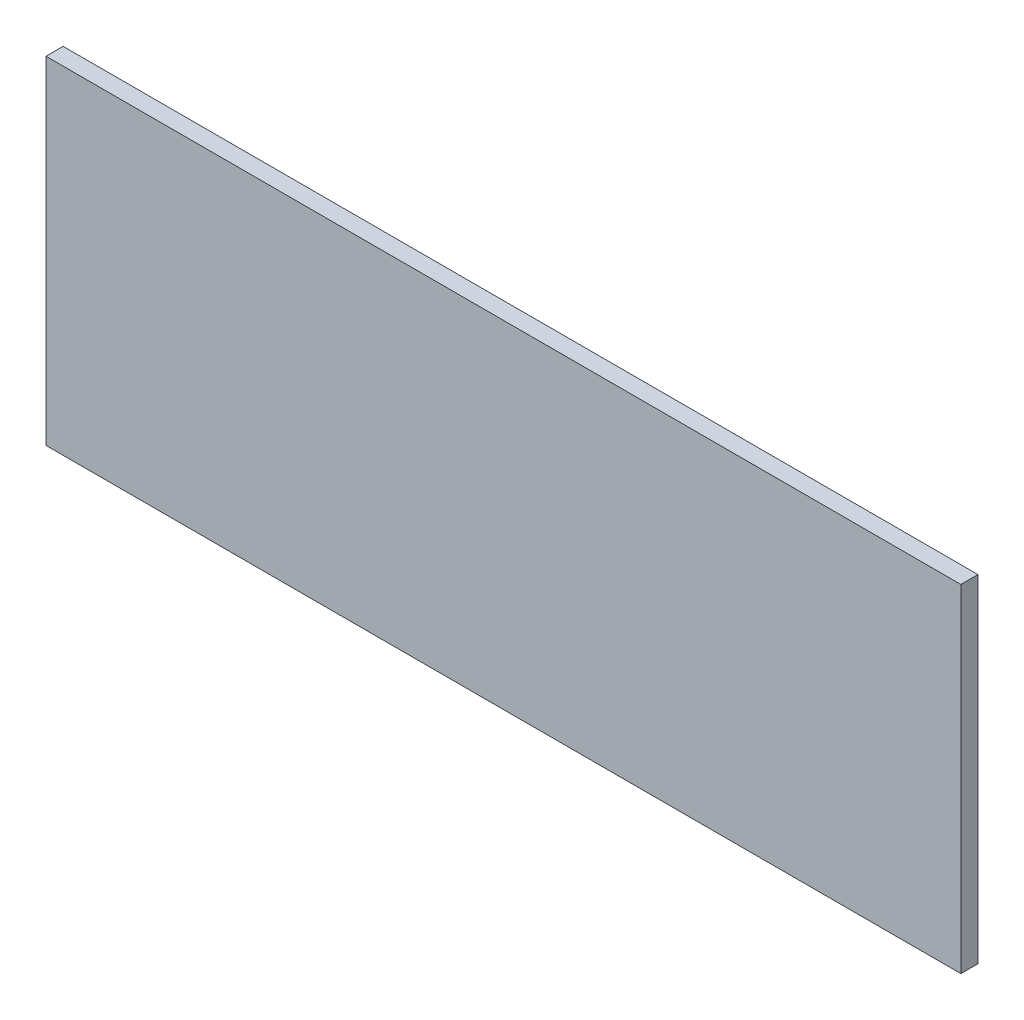
ISO-10303-21;
HEADER;
FILE_DESCRIPTION(('STEP AP214'),'2;1');
FILE_NAME('part.step','',(''),(''),'','','');
FILE_SCHEMA(('AUTOMOTIVE_DESIGN { 1 0 10303 214 1 1 1 1 }'));
ENDSEC;
DATA;
#1=APPLICATION_CONTEXT('core data for automotive mechanical design processes');
#2=APPLICATION_PROTOCOL_DEFINITION('international standard','automotive_design',2000,#1);
#3=PRODUCT_CONTEXT('',#1,'mechanical');
#4=PRODUCT('Part','Part','',(#3));
#5=PRODUCT_RELATED_PRODUCT_CATEGORY('part','',(#4));
#6=PRODUCT_DEFINITION_FORMATION('','',#4);
#7=PRODUCT_DEFINITION_CONTEXT('part definition',#1,'design');
#8=PRODUCT_DEFINITION('design','',#6,#7);
#9=PRODUCT_DEFINITION_SHAPE('','',#8);
#10=(LENGTH_UNIT() NAMED_UNIT(*) SI_UNIT(.MILLI.,.METRE.));
#11=(NAMED_UNIT(*) PLANE_ANGLE_UNIT() SI_UNIT($,.RADIAN.));
#12=(NAMED_UNIT(*) SI_UNIT($,.STERADIAN.) SOLID_ANGLE_UNIT());
#13=UNCERTAINTY_MEASURE_WITH_UNIT(LENGTH_MEASURE(1.E-05),#10,'distance_accuracy_value','');
#14=(GEOMETRIC_REPRESENTATION_CONTEXT(3) GLOBAL_UNCERTAINTY_ASSIGNED_CONTEXT((#13)) GLOBAL_UNIT_ASSIGNED_CONTEXT((#10,
#11,#12)) REPRESENTATION_CONTEXT('',''));
#15=CARTESIAN_POINT('',(0.,0.,0.));
#16=DIRECTION('',(0.,0.,1.));
#17=DIRECTION('',(1.,0.,0.));
#18=AXIS2_PLACEMENT_3D('',#15,#16,#17);
#19=CARTESIAN_POINT('',(96.5670013427734,68.8369979858399,0.));
#20=DIRECTION('',(0.,1.,0.));
#21=DIRECTION('',(1.,0.,0.));
#22=AXIS2_PLACEMENT_3D('',#19,#20,#21);
#23=PLANE('',#22);
#24=DIRECTION('',(1.,0.,0.));
#25=VECTOR('',#24,1.);
#26=CARTESIAN_POINT('',(96.5670013427734,68.8369979858398,0.03556));
#27=LINE('',#26,#25);
#28=CARTESIAN_POINT('',(96.5670013427734,68.8369979858398,0.03556));
#29=VERTEX_POINT('',#28);
#30=CARTESIAN_POINT('',(98.4670028686523,68.8369979858398,0.03556));
#31=VERTEX_POINT('',#30);
#32=EDGE_CURVE('E11',#29,#31,#27,.T.);
#33=ORIENTED_EDGE('',*,*,#32,.F.);
#34=DIRECTION('',(0.,0.,1.));
#35=VECTOR('',#34,1.);
#36=CARTESIAN_POINT('',(96.5670013427734,68.8369979858398,0.));
#37=LINE('',#36,#35);
#38=CARTESIAN_POINT('',(96.5670013427734,68.8369979858398,0.));
#39=VERTEX_POINT('',#38);
#40=EDGE_CURVE('E24',#39,#29,#37,.T.);
#41=ORIENTED_EDGE('',*,*,#40,.F.);
#42=DIRECTION('',(1.,0.,0.));
#43=VECTOR('',#42,1.);
#44=CARTESIAN_POINT('',(96.5670013427734,68.8369979858398,0.));
#45=LINE('',#44,#43);
#46=CARTESIAN_POINT('',(98.4670028686523,68.8369979858398,0.));
#47=VERTEX_POINT('',#46);
#48=EDGE_CURVE('E75',#39,#47,#45,.T.);
#49=ORIENTED_EDGE('',*,*,#48,.T.);
#50=DIRECTION('',(0.,0.,1.));
#51=VECTOR('',#50,1.);
#52=CARTESIAN_POINT('',(98.4670028686523,68.8369979858398,0.));
#53=LINE('',#52,#51);
#54=EDGE_CURVE('E37',#47,#31,#53,.T.);
#55=ORIENTED_EDGE('',*,*,#54,.T.);
#56=EDGE_LOOP('',(#33,#41,#49,#55));
#57=FACE_BOUND('',#56,.T.);
#58=ADVANCED_FACE('F17',(#57),#23,.F.);
#59=CARTESIAN_POINT('',(98.4670028686523,68.8369979858399,0.));
#60=DIRECTION('',(-1.,0.,0.));
#61=DIRECTION('',(0.,1.,0.));
#62=AXIS2_PLACEMENT_3D('',#59,#60,#61);
#63=PLANE('',#62);
#64=DIRECTION('',(0.,1.,0.));
#65=VECTOR('',#64,1.);
#66=CARTESIAN_POINT('',(98.4670028686523,68.8369979858398,0.03556));
#67=LINE('',#66,#65);
#68=CARTESIAN_POINT('',(98.4670028686523,69.5370025634766,0.03556));
#69=VERTEX_POINT('',#68);
#70=EDGE_CURVE('E83',#31,#69,#67,.T.);
#71=ORIENTED_EDGE('',*,*,#70,.F.);
#72=ORIENTED_EDGE('',*,*,#54,.F.);
#73=DIRECTION('',(0.,1.,0.));
#74=VECTOR('',#73,1.);
#75=CARTESIAN_POINT('',(98.4670028686523,68.8369979858398,0.));
#76=LINE('',#75,#74);
#77=CARTESIAN_POINT('',(98.4670028686523,69.5370025634766,0.));
#78=VERTEX_POINT('',#77);
#79=EDGE_CURVE('E81',#47,#78,#76,.T.);
#80=ORIENTED_EDGE('',*,*,#79,.T.);
#81=DIRECTION('',(0.,0.,1.));
#82=VECTOR('',#81,1.);
#83=CARTESIAN_POINT('',(98.4670028686523,69.5370025634766,0.));
#84=LINE('',#83,#82);
#85=EDGE_CURVE('E67',#78,#69,#84,.T.);
#86=ORIENTED_EDGE('',*,*,#85,.T.);
#87=EDGE_LOOP('',(#71,#72,#80,#86));
#88=FACE_BOUND('',#87,.T.);
#89=ADVANCED_FACE('F89',(#88),#63,.F.);
#90=CARTESIAN_POINT('',(98.4670028686523,69.5370025634766,0.));
#91=DIRECTION('',(0.,-1.,0.));
#92=DIRECTION('',(-1.,0.,0.));
#93=AXIS2_PLACEMENT_3D('',#90,#91,#92);
#94=PLANE('',#93);
#95=DIRECTION('',(-1.,0.,0.));
#96=VECTOR('',#95,1.);
#97=CARTESIAN_POINT('',(98.4670028686523,69.5370025634766,0.03556));
#98=LINE('',#97,#96);
#99=CARTESIAN_POINT('',(96.5670013427734,69.5370025634766,0.03556));
#100=VERTEX_POINT('',#99);
#101=EDGE_CURVE('E71',#69,#100,#98,.T.);
#102=ORIENTED_EDGE('',*,*,#101,.F.);
#103=ORIENTED_EDGE('',*,*,#85,.F.);
#104=DIRECTION('',(-1.,0.,0.));
#105=VECTOR('',#104,1.);
#106=CARTESIAN_POINT('',(98.4670028686523,69.5370025634766,0.));
#107=LINE('',#106,#105);
#108=CARTESIAN_POINT('',(96.5670013427734,69.5370025634766,0.));
#109=VERTEX_POINT('',#108);
#110=EDGE_CURVE('E63',#78,#109,#107,.T.);
#111=ORIENTED_EDGE('',*,*,#110,.T.);
#112=DIRECTION('',(0.,0.,1.));
#113=VECTOR('',#112,1.);
#114=CARTESIAN_POINT('',(96.5670013427734,69.5370025634766,0.));
#115=LINE('',#114,#113);
#116=EDGE_CURVE('E53',#109,#100,#115,.T.);
#117=ORIENTED_EDGE('',*,*,#116,.T.);
#118=EDGE_LOOP('',(#102,#103,#111,#117));
#119=FACE_BOUND('',#118,.T.);
#120=ADVANCED_FACE('F66',(#119),#94,.F.);
#121=CARTESIAN_POINT('',(96.5670013427734,69.5370025634766,0.));
#122=DIRECTION('',(1.,0.,0.));
#123=DIRECTION('',(0.,-1.,0.));
#124=AXIS2_PLACEMENT_3D('',#121,#122,#123);
#125=PLANE('',#124);
#126=DIRECTION('',(0.,-1.,0.));
#127=VECTOR('',#126,1.);
#128=CARTESIAN_POINT('',(96.5670013427734,69.5370025634766,0.03556));
#129=LINE('',#128,#127);
#130=EDGE_CURVE('E59',#100,#29,#129,.T.);
#131=ORIENTED_EDGE('',*,*,#130,.F.);
#132=ORIENTED_EDGE('',*,*,#116,.F.);
#133=DIRECTION('',(0.,-1.,0.));
#134=VECTOR('',#133,1.);
#135=CARTESIAN_POINT('',(96.5670013427734,69.5370025634766,0.));
#136=LINE('',#135,#134);
#137=EDGE_CURVE('E57',#109,#39,#136,.T.);
#138=ORIENTED_EDGE('',*,*,#137,.T.);
#139=ORIENTED_EDGE('',*,*,#40,.T.);
#140=EDGE_LOOP('',(#131,#132,#138,#139));
#141=FACE_BOUND('',#140,.T.);
#142=ADVANCED_FACE('F55',(#141),#125,.F.);
#143=CARTESIAN_POINT('',(96.5670013427734,68.8369979858399,0.));
#144=DIRECTION('',(0.,0.,-1.));
#145=DIRECTION('',(-1.,0.,0.));
#146=AXIS2_PLACEMENT_3D('',#143,#144,#145);
#147=PLANE('',#146);
#148=ORIENTED_EDGE('',*,*,#137,.F.);
#149=ORIENTED_EDGE('',*,*,#110,.F.);
#150=ORIENTED_EDGE('',*,*,#79,.F.);
#151=ORIENTED_EDGE('',*,*,#48,.F.);
#152=EDGE_LOOP('',(#148,#149,#150,#151));
#153=FACE_BOUND('',#152,.T.);
#154=ADVANCED_FACE('F74',(#153),#147,.T.);
#155=CARTESIAN_POINT('',(96.5670013427734,68.8369979858399,0.03556));
#156=DIRECTION('',(0.,0.,-1.));
#157=DIRECTION('',(-1.,0.,0.));
#158=AXIS2_PLACEMENT_3D('',#155,#156,#157);
#159=PLANE('',#158);
#160=ORIENTED_EDGE('',*,*,#32,.T.);
#161=ORIENTED_EDGE('',*,*,#70,.T.);
#162=ORIENTED_EDGE('',*,*,#101,.T.);
#163=ORIENTED_EDGE('',*,*,#130,.T.);
#164=EDGE_LOOP('',(#160,#161,#162,#163));
#165=FACE_BOUND('',#164,.T.);
#166=ADVANCED_FACE('F91',(#165),#159,.F.);
#167=CLOSED_SHELL('',(#58,#89,#120,#142,#154,#166));
#168=MANIFOLD_SOLID_BREP('B1',#167);
#169=ADVANCED_BREP_SHAPE_REPRESENTATION('',(#18,#168),#14);
#170=SHAPE_DEFINITION_REPRESENTATION(#9,#169);
ENDSEC;
END-ISO-10303-21;
